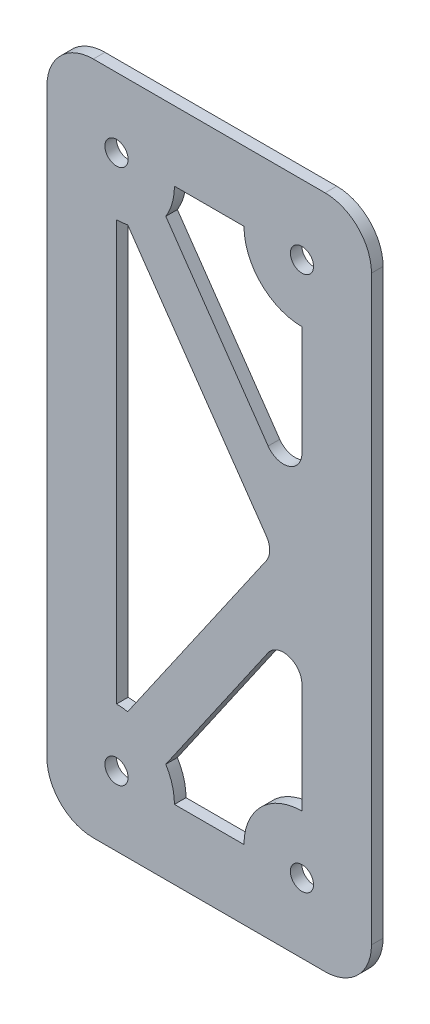
ISO-10303-21;
HEADER;
FILE_DESCRIPTION(('STEP AP214'),'2;1');
FILE_NAME('part.step','',(''),(''),'','','');
FILE_SCHEMA(('AUTOMOTIVE_DESIGN { 1 0 10303 214 1 1 1 1 }'));
ENDSEC;
DATA;
#1=APPLICATION_CONTEXT('core data for automotive mechanical design processes');
#2=APPLICATION_PROTOCOL_DEFINITION('international standard','automotive_design',2000,#1);
#3=PRODUCT_CONTEXT('',#1,'mechanical');
#4=PRODUCT('Part','Part','',(#3));
#5=PRODUCT_RELATED_PRODUCT_CATEGORY('part','',(#4));
#6=PRODUCT_DEFINITION_FORMATION('','',#4);
#7=PRODUCT_DEFINITION_CONTEXT('part definition',#1,'design');
#8=PRODUCT_DEFINITION('design','',#6,#7);
#9=PRODUCT_DEFINITION_SHAPE('','',#8);
#10=(LENGTH_UNIT() NAMED_UNIT(*) SI_UNIT(.MILLI.,.METRE.));
#11=(NAMED_UNIT(*) PLANE_ANGLE_UNIT() SI_UNIT($,.RADIAN.));
#12=(NAMED_UNIT(*) SI_UNIT($,.STERADIAN.) SOLID_ANGLE_UNIT());
#13=UNCERTAINTY_MEASURE_WITH_UNIT(LENGTH_MEASURE(1.E-05),#10,'distance_accuracy_value','');
#14=(GEOMETRIC_REPRESENTATION_CONTEXT(3) GLOBAL_UNCERTAINTY_ASSIGNED_CONTEXT((#13)) GLOBAL_UNIT_ASSIGNED_CONTEXT((#10,
#11,#12)) REPRESENTATION_CONTEXT('',''));
#15=CARTESIAN_POINT('',(0.,0.,0.));
#16=DIRECTION('',(0.,0.,1.));
#17=DIRECTION('',(1.,0.,0.));
#18=AXIS2_PLACEMENT_3D('',#15,#16,#17);
#19=CARTESIAN_POINT('',(1667.86072109709,0.,3.175));
#20=DIRECTION('',(1.,0.,0.));
#21=DIRECTION('',(0.,0.,-1.));
#22=AXIS2_PLACEMENT_3D('',#19,#20,#21);
#23=PLANE('',#22);
#24=DIRECTION('',(0.,-1.,0.));
#25=VECTOR('',#24,1.);
#26=CARTESIAN_POINT('',(1667.86072109709,0.,0.));
#27=LINE('',#26,#25);
#28=CARTESIAN_POINT('',(1667.86072109709,-4100.18496013182,0.));
#29=VERTEX_POINT('',#28);
#30=CARTESIAN_POINT('',(1667.86072109709,-4259.54741898572,0.));
#31=VERTEX_POINT('',#30);
#32=EDGE_CURVE('E463',#29,#31,#27,.T.);
#33=ORIENTED_EDGE('',*,*,#32,.F.);
#34=DIRECTION('',(0.,0.,-1.));
#35=VECTOR('',#34,1.);
#36=CARTESIAN_POINT('',(1667.86072109709,-4100.18496013182,3.175));
#37=LINE('',#36,#35);
#38=CARTESIAN_POINT('',(1667.86072109709,-4100.18496013182,3.175));
#39=VERTEX_POINT('',#38);
#40=EDGE_CURVE('E316',#29,#39,#37,.F.);
#41=ORIENTED_EDGE('',*,*,#40,.T.);
#42=DIRECTION('',(0.,-1.,0.));
#43=VECTOR('',#42,1.);
#44=CARTESIAN_POINT('',(1667.86072109709,0.,3.175));
#45=LINE('',#44,#43);
#46=CARTESIAN_POINT('',(1667.86072109709,-4259.54741898572,3.175));
#47=VERTEX_POINT('',#46);
#48=EDGE_CURVE('E492',#39,#47,#45,.T.);
#49=ORIENTED_EDGE('',*,*,#48,.T.);
#50=DIRECTION('',(0.,0.,-1.));
#51=VECTOR('',#50,1.);
#52=CARTESIAN_POINT('',(1667.86072109709,-4259.54741898572,0.));
#53=LINE('',#52,#51);
#54=EDGE_CURVE('E312',#47,#31,#53,.T.);
#55=ORIENTED_EDGE('',*,*,#54,.T.);
#56=EDGE_LOOP('',(#33,#41,#49,#55));
#57=FACE_BOUND('',#56,.T.);
#58=ADVANCED_FACE('F40',(#57),#23,.T.);
#59=CARTESIAN_POINT('',(0.,-4087.48496013182,3.175));
#60=DIRECTION('',(0.,1.,0.));
#61=DIRECTION('',(0.,0.,1.));
#62=AXIS2_PLACEMENT_3D('',#59,#60,#61);
#63=PLANE('',#62);
#64=DIRECTION('',(1.,0.,0.));
#65=VECTOR('',#64,1.);
#66=CARTESIAN_POINT('',(0.,-4087.48496013182,3.175));
#67=LINE('',#66,#65);
#68=CARTESIAN_POINT('',(1591.66072109709,-4087.48496013182,3.175));
#69=VERTEX_POINT('',#68);
#70=CARTESIAN_POINT('',(1655.16072109709,-4087.48496013182,3.175));
#71=VERTEX_POINT('',#70);
#72=EDGE_CURVE('E483',#69,#71,#67,.T.);
#73=ORIENTED_EDGE('',*,*,#72,.T.);
#74=DIRECTION('',(0.,0.,-1.));
#75=VECTOR('',#74,1.);
#76=CARTESIAN_POINT('',(1655.16072109709,-4087.48496013182,3.175));
#77=LINE('',#76,#75);
#78=CARTESIAN_POINT('',(1655.16072109709,-4087.48496013182,0.));
#79=VERTEX_POINT('',#78);
#80=EDGE_CURVE('E296',#71,#79,#77,.T.);
#81=ORIENTED_EDGE('',*,*,#80,.T.);
#82=DIRECTION('',(1.,0.,0.));
#83=VECTOR('',#82,1.);
#84=CARTESIAN_POINT('',(0.,-4087.48496013182,0.));
#85=LINE('',#84,#83);
#86=CARTESIAN_POINT('',(1591.66072109709,-4087.48496013182,0.));
#87=VERTEX_POINT('',#86);
#88=EDGE_CURVE('E359',#87,#79,#85,.T.);
#89=ORIENTED_EDGE('',*,*,#88,.F.);
#90=DIRECTION('',(0.,0.,-1.));
#91=VECTOR('',#90,1.);
#92=CARTESIAN_POINT('',(1591.66072109709,-4087.48496013182,3.175));
#93=LINE('',#92,#91);
#94=EDGE_CURVE('E293',#87,#69,#93,.F.);
#95=ORIENTED_EDGE('',*,*,#94,.T.);
#96=EDGE_LOOP('',(#73,#81,#89,#95));
#97=FACE_BOUND('',#96,.T.);
#98=ADVANCED_FACE('F473',(#97),#63,.T.);
#99=CARTESIAN_POINT('',(1578.96072109709,0.,3.175));
#100=DIRECTION('',(1.,0.,0.));
#101=DIRECTION('',(0.,0.,-1.));
#102=AXIS2_PLACEMENT_3D('',#99,#100,#101);
#103=PLANE('',#102);
#104=DIRECTION('',(0.,-1.,0.));
#105=VECTOR('',#104,1.);
#106=CARTESIAN_POINT('',(1578.96072109709,0.,3.175));
#107=LINE('',#106,#105);
#108=CARTESIAN_POINT('',(1578.96072109709,-4100.18496013182,3.175));
#109=VERTEX_POINT('',#108);
#110=CARTESIAN_POINT('',(1578.96072109709,-4259.54741898572,3.175));
#111=VERTEX_POINT('',#110);
#112=EDGE_CURVE('E482',#109,#111,#107,.T.);
#113=ORIENTED_EDGE('',*,*,#112,.F.);
#114=DIRECTION('',(0.,0.,-1.));
#115=VECTOR('',#114,1.);
#116=CARTESIAN_POINT('',(1578.96072109709,-4100.18496013182,0.));
#117=LINE('',#116,#115);
#118=CARTESIAN_POINT('',(1578.96072109709,-4100.18496013182,0.));
#119=VERTEX_POINT('',#118);
#120=EDGE_CURVE('E333',#109,#119,#117,.T.);
#121=ORIENTED_EDGE('',*,*,#120,.T.);
#122=DIRECTION('',(0.,-1.,0.));
#123=VECTOR('',#122,1.);
#124=CARTESIAN_POINT('',(1578.96072109709,0.,0.));
#125=LINE('',#124,#123);
#126=CARTESIAN_POINT('',(1578.96072109709,-4259.54741898572,0.));
#127=VERTEX_POINT('',#126);
#128=EDGE_CURVE('E353',#119,#127,#125,.T.);
#129=ORIENTED_EDGE('',*,*,#128,.T.);
#130=DIRECTION('',(0.,0.,-1.));
#131=VECTOR('',#130,1.);
#132=CARTESIAN_POINT('',(1578.96072109709,-4259.54741898572,3.175));
#133=LINE('',#132,#131);
#134=EDGE_CURVE('E330',#127,#111,#133,.F.);
#135=ORIENTED_EDGE('',*,*,#134,.T.);
#136=EDGE_LOOP('',(#113,#121,#129,#135));
#137=FACE_BOUND('',#136,.T.);
#138=ADVANCED_FACE('F485',(#137),#103,.F.);
#139=CARTESIAN_POINT('',(1648.81072109709,-4253.19741898572,3.175));
#140=DIRECTION('',(0.,0.,-1.));
#141=DIRECTION('',(-1.,0.,0.));
#142=AXIS2_PLACEMENT_3D('',#139,#140,#141);
#143=CYLINDRICAL_SURFACE('',#142,15.8749999999997);
#144=CARTESIAN_POINT('',(1648.81072109709,-4253.19741898572,0.));
#145=DIRECTION('',(0.,0.,1.));
#146=DIRECTION('',(1.,0.,0.));
#147=AXIS2_PLACEMENT_3D('',#144,#145,#146);
#148=CIRCLE('',#147,15.8749999999997);
#149=CARTESIAN_POINT('',(1648.81072109709,-4237.32241898572,0.));
#150=VERTEX_POINT('',#149);
#151=CARTESIAN_POINT('',(1632.93572109709,-4253.19741898572,0.));
#152=VERTEX_POINT('',#151);
#153=EDGE_CURVE('E441',#150,#152,#148,.T.);
#154=ORIENTED_EDGE('',*,*,#153,.T.);
#155=DIRECTION('',(0.,0.,-1.));
#156=VECTOR('',#155,1.);
#157=CARTESIAN_POINT('',(1632.93572109709,-4253.19741898572,3.175));
#158=LINE('',#157,#156);
#159=CARTESIAN_POINT('',(1632.93572109709,-4253.19741898572,3.175));
#160=VERTEX_POINT('',#159);
#161=EDGE_CURVE('E260',#160,#152,#158,.T.);
#162=ORIENTED_EDGE('',*,*,#161,.F.);
#163=CARTESIAN_POINT('',(1648.81072109709,-4253.19741898572,3.175));
#164=DIRECTION('',(0.,0.,1.));
#165=DIRECTION('',(1.,0.,0.));
#166=AXIS2_PLACEMENT_3D('',#163,#164,#165);
#167=CIRCLE('',#166,15.8749999999997);
#168=CARTESIAN_POINT('',(1648.81072109709,-4237.32241898572,3.175));
#169=VERTEX_POINT('',#168);
#170=EDGE_CURVE('E530',#169,#160,#167,.T.);
#171=ORIENTED_EDGE('',*,*,#170,.F.);
#172=DIRECTION('',(0.,0.,-1.));
#173=VECTOR('',#172,1.);
#174=CARTESIAN_POINT('',(1648.81072109709,-4237.32241898572,3.175));
#175=LINE('',#174,#173);
#176=EDGE_CURVE('E363',#169,#150,#175,.T.);
#177=ORIENTED_EDGE('',*,*,#176,.T.);
#178=EDGE_LOOP('',(#154,#162,#171,#177));
#179=FACE_BOUND('',#178,.T.);
#180=ADVANCED_FACE('F599',(#179),#143,.T.);
#181=CARTESIAN_POINT('',(7.43621685485709E-11,-4253.19741898575,3.175));
#182=DIRECTION('',(0.,-1.,0.));
#183=DIRECTION('',(1.,0.,0.));
#184=AXIS2_PLACEMENT_3D('',#181,#182,#183);
#185=PLANE('',#184);
#186=DIRECTION('',(-1.,0.,0.));
#187=VECTOR('',#186,1.);
#188=CARTESIAN_POINT('',(7.43621685485709E-11,-4253.19741898575,0.));
#189=LINE('',#188,#187);
#190=CARTESIAN_POINT('',(1613.88572109709,-4253.19741898572,0.));
#191=VERTEX_POINT('',#190);
#192=EDGE_CURVE('E445',#152,#191,#189,.T.);
#193=ORIENTED_EDGE('',*,*,#192,.T.);
#194=DIRECTION('',(0.,0.,-1.));
#195=VECTOR('',#194,1.);
#196=CARTESIAN_POINT('',(1613.88572109709,-4253.19741898572,3.175));
#197=LINE('',#196,#195);
#198=CARTESIAN_POINT('',(1613.88572109709,-4253.19741898572,3.175));
#199=VERTEX_POINT('',#198);
#200=EDGE_CURVE('E372',#199,#191,#197,.T.);
#201=ORIENTED_EDGE('',*,*,#200,.F.);
#202=DIRECTION('',(-1.,0.,0.));
#203=VECTOR('',#202,1.);
#204=CARTESIAN_POINT('',(7.43621685485709E-11,-4253.19741898575,3.175));
#205=LINE('',#204,#203);
#206=EDGE_CURVE('E534',#160,#199,#205,.T.);
#207=ORIENTED_EDGE('',*,*,#206,.F.);
#208=ORIENTED_EDGE('',*,*,#161,.T.);
#209=EDGE_LOOP('',(#193,#201,#207,#208));
#210=FACE_BOUND('',#209,.T.);
#211=ADVANCED_FACE('F595',(#210),#185,.F.);
#212=CARTESIAN_POINT('',(1598.01072109709,-4253.19741898572,3.175));
#213=DIRECTION('',(0.,0.,-1.));
#214=DIRECTION('',(-1.,0.,0.));
#215=AXIS2_PLACEMENT_3D('',#212,#213,#214);
#216=CYLINDRICAL_SURFACE('',#215,15.8749999999997);
#217=CARTESIAN_POINT('',(1598.01072109709,-4253.19741898572,0.));
#218=DIRECTION('',(0.,0.,1.));
#219=DIRECTION('',(1.,0.,0.));
#220=AXIS2_PLACEMENT_3D('',#217,#218,#219);
#221=CIRCLE('',#220,15.8749999999997);
#222=CARTESIAN_POINT('',(1611.51594221686,-4244.85328167225,0.));
#223=VERTEX_POINT('',#222);
#224=EDGE_CURVE('E448',#191,#223,#221,.T.);
#225=ORIENTED_EDGE('',*,*,#224,.T.);
#226=DIRECTION('',(0.,0.,-1.));
#227=VECTOR('',#226,1.);
#228=CARTESIAN_POINT('',(1611.51594221686,-4244.85328167225,3.175));
#229=LINE('',#228,#227);
#230=CARTESIAN_POINT('',(1611.51594221686,-4244.85328167225,3.175));
#231=VERTEX_POINT('',#230);
#232=EDGE_CURVE('E367',#231,#223,#229,.T.);
#233=ORIENTED_EDGE('',*,*,#232,.F.);
#234=CARTESIAN_POINT('',(1598.01072109709,-4253.19741898572,3.175));
#235=DIRECTION('',(0.,0.,1.));
#236=DIRECTION('',(1.,0.,0.));
#237=AXIS2_PLACEMENT_3D('',#234,#235,#236);
#238=CIRCLE('',#237,15.8749999999997);
#239=EDGE_CURVE('E537',#199,#231,#238,.T.);
#240=ORIENTED_EDGE('',*,*,#239,.F.);
#241=ORIENTED_EDGE('',*,*,#200,.T.);
#242=EDGE_LOOP('',(#225,#233,#240,#241));
#243=FACE_BOUND('',#242,.T.);
#244=ADVANCED_FACE('F591',(#243),#216,.T.);
#245=CARTESIAN_POINT('',(3075.97149747778,-2130.87048032548,3.175));
#246=DIRECTION('',(0.822023094017505,-0.56945415346794,0.));
#247=DIRECTION('',(0.56945415346794,0.822023094017505,0.));
#248=AXIS2_PLACEMENT_3D('',#245,#246,#247);
#249=PLANE('',#248);
#250=DIRECTION('',(-0.56945415346794,-0.822023094017505,0.));
#251=VECTOR('',#250,1.);
#252=CARTESIAN_POINT('',(3075.97149747778,-2130.87048032548,0.));
#253=LINE('',#252,#251);
#254=CARTESIAN_POINT('',(1639.55484377948,-4204.37833829886,0.));
#255=VERTEX_POINT('',#254);
#256=EDGE_CURVE('E452',#255,#223,#253,.T.);
#257=ORIENTED_EDGE('',*,*,#256,.F.);
#258=DIRECTION('',(0.,0.,-1.));
#259=VECTOR('',#258,1.);
#260=CARTESIAN_POINT('',(1639.55484377948,-4204.37833829885,3.175));
#261=LINE('',#260,#259);
#262=CARTESIAN_POINT('',(1639.55484377948,-4204.37833829886,3.175));
#263=VERTEX_POINT('',#262);
#264=EDGE_CURVE('E267',#255,#263,#261,.F.);
#265=ORIENTED_EDGE('',*,*,#264,.T.);
#266=DIRECTION('',(-0.56945415346794,-0.822023094017505,0.));
#267=VECTOR('',#266,1.);
#268=CARTESIAN_POINT('',(3075.97149747778,-2130.87048032548,3.175));
#269=LINE('',#268,#267);
#270=EDGE_CURVE('E540',#263,#231,#269,.T.);
#271=ORIENTED_EDGE('',*,*,#270,.T.);
#272=ORIENTED_EDGE('',*,*,#232,.T.);
#273=EDGE_LOOP('',(#257,#265,#271,#272));
#274=FACE_BOUND('',#273,.T.);
#275=ADVANCED_FACE('F587',(#274),#249,.T.);
#276=CARTESIAN_POINT('',(1598.01072109709,-4106.53496013182,3.175));
#277=DIRECTION('',(0.,0.,-1.));
#278=DIRECTION('',(-1.,0.,0.));
#279=AXIS2_PLACEMENT_3D('',#276,#277,#278);
#280=CYLINDRICAL_SURFACE('',#279,15.8749999999997);
#281=CARTESIAN_POINT('',(1598.01072109709,-4106.53496013182,0.));
#282=DIRECTION('',(0.,0.,1.));
#283=DIRECTION('',(1.,0.,0.));
#284=AXIS2_PLACEMENT_3D('',#281,#282,#283);
#285=CIRCLE('',#284,15.8749999999997);
#286=CARTESIAN_POINT('',(1598.01072109709,-4122.40996013182,0.));
#287=VERTEX_POINT('',#286);
#288=CARTESIAN_POINT('',(1601.07624892284,-4122.11116519433,0.));
#289=VERTEX_POINT('',#288);
#290=EDGE_CURVE('E414',#287,#289,#285,.T.);
#291=ORIENTED_EDGE('',*,*,#290,.T.);
#292=DIRECTION('',(0.,0.,-1.));
#293=VECTOR('',#292,1.);
#294=CARTESIAN_POINT('',(1601.07624892284,-4122.11116519433,3.175));
#295=LINE('',#294,#293);
#296=CARTESIAN_POINT('',(1601.07624892284,-4122.11116519433,3.175));
#297=VERTEX_POINT('',#296);
#298=EDGE_CURVE('E368',#297,#289,#295,.T.);
#299=ORIENTED_EDGE('',*,*,#298,.F.);
#300=CARTESIAN_POINT('',(1598.01072109709,-4106.53496013182,3.175));
#301=DIRECTION('',(0.,0.,1.));
#302=DIRECTION('',(1.,0.,0.));
#303=AXIS2_PLACEMENT_3D('',#300,#301,#302);
#304=CIRCLE('',#303,15.8749999999997);
#305=CARTESIAN_POINT('',(1598.01072109709,-4122.40996013182,3.175));
#306=VERTEX_POINT('',#305);
#307=EDGE_CURVE('E509',#306,#297,#304,.T.);
#308=ORIENTED_EDGE('',*,*,#307,.F.);
#309=DIRECTION('',(0.,0.,-1.));
#310=VECTOR('',#309,1.);
#311=CARTESIAN_POINT('',(1598.01072109709,-4122.40996013182,3.175));
#312=LINE('',#311,#310);
#313=EDGE_CURVE('E244',#306,#287,#312,.T.);
#314=ORIENTED_EDGE('',*,*,#313,.T.);
#315=EDGE_LOOP('',(#291,#299,#308,#314));
#316=FACE_BOUND('',#315,.T.);
#317=ADVANCED_FACE('F590',(#316),#280,.T.);
#318=CARTESIAN_POINT('',(-847.696249813411,-587.239158910005,3.175));
#319=DIRECTION('',(-0.822023094017507,-0.569454153467937,0.));
#320=DIRECTION('',(0.569454153467937,-0.822023094017507,0.));
#321=AXIS2_PLACEMENT_3D('',#318,#319,#320);
#322=PLANE('',#321);
#323=DIRECTION('',(-0.569454153467937,0.822023094017507,0.));
#324=VECTOR('',#323,1.);
#325=CARTESIAN_POINT('',(-847.696249813411,-587.239158910005,0.));
#326=LINE('',#325,#324);
#327=CARTESIAN_POINT('',(1639.08187957749,-4176.97336245915,0.));
#328=VERTEX_POINT('',#327);
#329=EDGE_CURVE('E425',#328,#289,#326,.T.);
#330=ORIENTED_EDGE('',*,*,#329,.F.);
#331=DIRECTION('',(0.,0.,-1.));
#332=VECTOR('',#331,1.);
#333=CARTESIAN_POINT('',(1639.08187957749,-4176.97336245915,3.175));
#334=LINE('',#333,#332);
#335=CARTESIAN_POINT('',(1639.08187957749,-4176.97336245915,3.175));
#336=VERTEX_POINT('',#335);
#337=EDGE_CURVE('E259',#328,#336,#334,.F.);
#338=ORIENTED_EDGE('',*,*,#337,.T.);
#339=DIRECTION('',(-0.569454153467937,0.822023094017507,0.));
#340=VECTOR('',#339,1.);
#341=CARTESIAN_POINT('',(-847.696249813411,-587.239158910005,3.175));
#342=LINE('',#341,#340);
#343=EDGE_CURVE('E514',#336,#297,#342,.T.);
#344=ORIENTED_EDGE('',*,*,#343,.T.);
#345=ORIENTED_EDGE('',*,*,#298,.T.);
#346=EDGE_LOOP('',(#330,#338,#344,#345));
#347=FACE_BOUND('',#346,.T.);
#348=ADVANCED_FACE('F618',(#347),#322,.T.);
#349=CARTESIAN_POINT('',(3065.53180418376,-2123.63841257638,3.175));
#350=DIRECTION('',(0.822023094017512,-0.569454153467929,0.));
#351=DIRECTION('',(0.569454153467929,0.822023094017512,0.));
#352=AXIS2_PLACEMENT_3D('',#349,#350,#351);
#353=PLANE('',#352);
#354=DIRECTION('',(-0.569454153467929,-0.822023094017512,0.));
#355=VECTOR('',#354,1.);
#356=CARTESIAN_POINT('',(3065.53180418376,-2123.63841257638,3.175));
#357=LINE('',#356,#355);
#358=CARTESIAN_POINT('',(1639.08187957749,-4182.75901665839,3.175));
#359=VERTEX_POINT('',#358);
#360=CARTESIAN_POINT('',(1601.07624892284,-4237.6212139232,3.175));
#361=VERTEX_POINT('',#360);
#362=EDGE_CURVE('E517',#359,#361,#357,.T.);
#363=ORIENTED_EDGE('',*,*,#362,.F.);
#364=DIRECTION('',(0.,0.,-1.));
#365=VECTOR('',#364,1.);
#366=CARTESIAN_POINT('',(1639.08187957749,-4182.75901665839,3.175));
#367=LINE('',#366,#365);
#368=CARTESIAN_POINT('',(1639.08187957749,-4182.75901665839,0.));
#369=VERTEX_POINT('',#368);
#370=EDGE_CURVE('E255',#359,#369,#367,.T.);
#371=ORIENTED_EDGE('',*,*,#370,.T.);
#372=DIRECTION('',(-0.569454153467929,-0.822023094017512,0.));
#373=VECTOR('',#372,1.);
#374=CARTESIAN_POINT('',(3065.53180418376,-2123.63841257638,0.));
#375=LINE('',#374,#373);
#376=CARTESIAN_POINT('',(1601.07624892284,-4237.6212139232,0.));
#377=VERTEX_POINT('',#376);
#378=EDGE_CURVE('E428',#369,#377,#375,.T.);
#379=ORIENTED_EDGE('',*,*,#378,.T.);
#380=DIRECTION('',(0.,0.,-1.));
#381=VECTOR('',#380,1.);
#382=CARTESIAN_POINT('',(1601.07624892284,-4237.6212139232,3.175));
#383=LINE('',#382,#381);
#384=EDGE_CURVE('E382',#361,#377,#383,.T.);
#385=ORIENTED_EDGE('',*,*,#384,.F.);
#386=EDGE_LOOP('',(#363,#371,#379,#385));
#387=FACE_BOUND('',#386,.T.);
#388=ADVANCED_FACE('F614',(#387),#353,.F.);
#389=CARTESIAN_POINT('',(1598.01072109709,-4253.19741898572,3.175));
#390=DIRECTION('',(0.,0.,-1.));
#391=DIRECTION('',(-1.,0.,0.));
#392=AXIS2_PLACEMENT_3D('',#389,#390,#391);
#393=CYLINDRICAL_SURFACE('',#392,15.8749999999997);
#394=CARTESIAN_POINT('',(1598.01072109709,-4253.19741898572,0.));
#395=DIRECTION('',(0.,0.,1.));
#396=DIRECTION('',(1.,0.,0.));
#397=AXIS2_PLACEMENT_3D('',#394,#395,#396);
#398=CIRCLE('',#397,15.8749999999997);
#399=CARTESIAN_POINT('',(1598.01072109709,-4237.32241898572,0.));
#400=VERTEX_POINT('',#399);
#401=EDGE_CURVE('E431',#377,#400,#398,.T.);
#402=ORIENTED_EDGE('',*,*,#401,.T.);
#403=DIRECTION('',(0.,0.,-1.));
#404=VECTOR('',#403,1.);
#405=CARTESIAN_POINT('',(1598.01072109709,-4237.32241898572,3.175));
#406=LINE('',#405,#404);
#407=CARTESIAN_POINT('',(1598.01072109709,-4237.32241898572,3.175));
#408=VERTEX_POINT('',#407);
#409=EDGE_CURVE('E248',#408,#400,#406,.T.);
#410=ORIENTED_EDGE('',*,*,#409,.F.);
#411=CARTESIAN_POINT('',(1598.01072109709,-4253.19741898572,3.175));
#412=DIRECTION('',(0.,0.,1.));
#413=DIRECTION('',(1.,0.,0.));
#414=AXIS2_PLACEMENT_3D('',#411,#412,#413);
#415=CIRCLE('',#414,15.8749999999997);
#416=EDGE_CURVE('E520',#361,#408,#415,.T.);
#417=ORIENTED_EDGE('',*,*,#416,.F.);
#418=ORIENTED_EDGE('',*,*,#384,.T.);
#419=EDGE_LOOP('',(#402,#410,#417,#418));
#420=FACE_BOUND('',#419,.T.);
#421=ADVANCED_FACE('F611',(#420),#393,.T.);
#422=CARTESIAN_POINT('',(-837.256556519391,-580.007091160965,3.175));
#423=DIRECTION('',(-0.822023094017507,-0.569454153467938,0.));
#424=DIRECTION('',(0.569454153467938,-0.822023094017507,0.));
#425=AXIS2_PLACEMENT_3D('',#422,#423,#424);
#426=PLANE('',#425);
#427=DIRECTION('',(-0.569454153467938,0.822023094017507,0.));
#428=VECTOR('',#427,1.);
#429=CARTESIAN_POINT('',(-837.256556519391,-580.007091160965,3.175));
#430=LINE('',#429,#428);
#431=CARTESIAN_POINT('',(1639.55484377948,-4155.35404081868,3.175));
#432=VERTEX_POINT('',#431);
#433=CARTESIAN_POINT('',(1611.51594221686,-4114.87909744529,3.175));
#434=VERTEX_POINT('',#433);
#435=EDGE_CURVE('E213',#432,#434,#430,.T.);
#436=ORIENTED_EDGE('',*,*,#435,.F.);
#437=DIRECTION('',(0.,0.,-1.));
#438=VECTOR('',#437,1.);
#439=CARTESIAN_POINT('',(1639.55484377948,-4155.35404081868,0.));
#440=LINE('',#439,#438);
#441=CARTESIAN_POINT('',(1639.55484377948,-4155.35404081868,0.));
#442=VERTEX_POINT('',#441);
#443=EDGE_CURVE('E270',#432,#442,#440,.T.);
#444=ORIENTED_EDGE('',*,*,#443,.T.);
#445=DIRECTION('',(-0.569454153467938,0.822023094017507,0.));
#446=VECTOR('',#445,1.);
#447=CARTESIAN_POINT('',(-837.256556519391,-580.007091160965,0.));
#448=LINE('',#447,#446);
#449=CARTESIAN_POINT('',(1611.51594221686,-4114.87909744529,0.));
#450=VERTEX_POINT('',#449);
#451=EDGE_CURVE('E241',#442,#450,#448,.T.);
#452=ORIENTED_EDGE('',*,*,#451,.T.);
#453=DIRECTION('',(0.,0.,-1.));
#454=VECTOR('',#453,1.);
#455=CARTESIAN_POINT('',(1611.51594221686,-4114.87909744529,3.175));
#456=LINE('',#455,#454);
#457=EDGE_CURVE('E232',#434,#450,#456,.T.);
#458=ORIENTED_EDGE('',*,*,#457,.F.);
#459=EDGE_LOOP('',(#436,#444,#452,#458));
#460=FACE_BOUND('',#459,.T.);
#461=ADVANCED_FACE('F239',(#460),#426,.F.);
#462=CARTESIAN_POINT('',(1598.01072109709,-4106.53496013182,3.175));
#463=DIRECTION('',(0.,0.,-1.));
#464=DIRECTION('',(-1.,0.,0.));
#465=AXIS2_PLACEMENT_3D('',#462,#463,#464);
#466=CYLINDRICAL_SURFACE('',#465,15.8749999999997);
#467=CARTESIAN_POINT('',(1598.01072109709,-4106.53496013182,0.));
#468=DIRECTION('',(0.,0.,1.));
#469=DIRECTION('',(1.,0.,0.));
#470=AXIS2_PLACEMENT_3D('',#467,#468,#469);
#471=CIRCLE('',#470,15.8749999999997);
#472=CARTESIAN_POINT('',(1613.88572109709,-4106.53496013182,0.));
#473=VERTEX_POINT('',#472);
#474=EDGE_CURVE('E418',#450,#473,#471,.T.);
#475=ORIENTED_EDGE('',*,*,#474,.T.);
#476=DIRECTION('',(0.,0.,-1.));
#477=VECTOR('',#476,1.);
#478=CARTESIAN_POINT('',(1613.88572109709,-4106.53496013182,3.175));
#479=LINE('',#478,#477);
#480=CARTESIAN_POINT('',(1613.88572109709,-4106.53496013182,3.175));
#481=VERTEX_POINT('',#480);
#482=EDGE_CURVE('E234',#481,#473,#479,.T.);
#483=ORIENTED_EDGE('',*,*,#482,.F.);
#484=CARTESIAN_POINT('',(1598.01072109709,-4106.53496013182,3.175));
#485=DIRECTION('',(0.,0.,1.));
#486=DIRECTION('',(1.,0.,0.));
#487=AXIS2_PLACEMENT_3D('',#484,#485,#486);
#488=CIRCLE('',#487,15.8749999999997);
#489=EDGE_CURVE('E218',#434,#481,#488,.T.);
#490=ORIENTED_EDGE('',*,*,#489,.F.);
#491=ORIENTED_EDGE('',*,*,#457,.T.);
#492=EDGE_LOOP('',(#475,#483,#490,#491));
#493=FACE_BOUND('',#492,.T.);
#494=ADVANCED_FACE('F231',(#493),#466,.T.);
#495=CARTESIAN_POINT('',(7.17979474671891E-11,-4106.53496013184,3.175));
#496=DIRECTION('',(0.,1.,0.));
#497=DIRECTION('',(-1.,0.,0.));
#498=AXIS2_PLACEMENT_3D('',#495,#496,#497);
#499=PLANE('',#498);
#500=DIRECTION('',(1.,0.,0.));
#501=VECTOR('',#500,1.);
#502=CARTESIAN_POINT('',(7.17979474671891E-11,-4106.53496013184,0.));
#503=LINE('',#502,#501);
#504=CARTESIAN_POINT('',(1632.93572109709,-4106.53496013182,0.));
#505=VERTEX_POINT('',#504);
#506=EDGE_CURVE('E407',#473,#505,#503,.T.);
#507=ORIENTED_EDGE('',*,*,#506,.T.);
#508=DIRECTION('',(0.,0.,-1.));
#509=VECTOR('',#508,1.);
#510=CARTESIAN_POINT('',(1632.93572109709,-4106.53496013182,3.175));
#511=LINE('',#510,#509);
#512=CARTESIAN_POINT('',(1632.93572109709,-4106.53496013182,3.175));
#513=VERTEX_POINT('',#512);
#514=EDGE_CURVE('E251',#513,#505,#511,.T.);
#515=ORIENTED_EDGE('',*,*,#514,.F.);
#516=DIRECTION('',(1.,0.,0.));
#517=VECTOR('',#516,1.);
#518=CARTESIAN_POINT('',(7.17979474671891E-11,-4106.53496013184,3.175));
#519=LINE('',#518,#517);
#520=EDGE_CURVE('E237',#481,#513,#519,.T.);
#521=ORIENTED_EDGE('',*,*,#520,.F.);
#522=ORIENTED_EDGE('',*,*,#482,.T.);
#523=EDGE_LOOP('',(#507,#515,#521,#522));
#524=FACE_BOUND('',#523,.T.);
#525=ADVANCED_FACE('F501',(#524),#499,.F.);
#526=CARTESIAN_POINT('',(1648.81072109709,-4106.53496013182,3.175));
#527=DIRECTION('',(0.,0.,-1.));
#528=DIRECTION('',(-1.,0.,0.));
#529=AXIS2_PLACEMENT_3D('',#526,#527,#528);
#530=CYLINDRICAL_SURFACE('',#529,15.8749999999997);
#531=CARTESIAN_POINT('',(1648.81072109709,-4106.53496013182,0.));
#532=DIRECTION('',(0.,0.,1.));
#533=DIRECTION('',(1.,0.,0.));
#534=AXIS2_PLACEMENT_3D('',#531,#532,#533);
#535=CIRCLE('',#534,15.8749999999997);
#536=CARTESIAN_POINT('',(1648.81072109709,-4122.40996013182,0.));
#537=VERTEX_POINT('',#536);
#538=EDGE_CURVE('E400',#505,#537,#535,.T.);
#539=ORIENTED_EDGE('',*,*,#538,.T.);
#540=DIRECTION('',(0.,0.,-1.));
#541=VECTOR('',#540,1.);
#542=CARTESIAN_POINT('',(1648.81072109709,-4122.40996013182,3.175));
#543=LINE('',#542,#541);
#544=CARTESIAN_POINT('',(1648.81072109709,-4122.40996013182,3.175));
#545=VERTEX_POINT('',#544);
#546=EDGE_CURVE('E389',#545,#537,#543,.T.);
#547=ORIENTED_EDGE('',*,*,#546,.F.);
#548=CARTESIAN_POINT('',(1648.81072109709,-4106.53496013182,3.175));
#549=DIRECTION('',(0.,0.,1.));
#550=DIRECTION('',(1.,0.,0.));
#551=AXIS2_PLACEMENT_3D('',#548,#549,#550);
#552=CIRCLE('',#551,15.8749999999997);
#553=EDGE_CURVE('E401',#513,#545,#552,.T.);
#554=ORIENTED_EDGE('',*,*,#553,.F.);
#555=ORIENTED_EDGE('',*,*,#514,.T.);
#556=EDGE_LOOP('',(#539,#547,#554,#555));
#557=FACE_BOUND('',#556,.T.);
#558=ADVANCED_FACE('F398',(#557),#530,.T.);
#559=CARTESIAN_POINT('',(1598.01072109709,-4253.19741898572,3.175));
#560=DIRECTION('',(0.,0.,-1.));
#561=DIRECTION('',(-1.,0.,0.));
#562=AXIS2_PLACEMENT_3D('',#559,#560,#561);
#563=CYLINDRICAL_SURFACE('',#562,3.17499999999975);
#564=CARTESIAN_POINT('',(1598.01072109709,-4253.19741898572,3.175));
#565=DIRECTION('',(0.,0.,1.));
#566=DIRECTION('',(1.,0.,0.));
#567=AXIS2_PLACEMENT_3D('',#564,#565,#566);
#568=CIRCLE('',#567,3.17499999999975);
#569=CARTESIAN_POINT('',(1601.18572109709,-4253.19741898572,3.175));
#570=VERTEX_POINT('',#569);
#571=EDGE_CURVE('E547',#570,#570,#568,.T.);
#572=ORIENTED_EDGE('',*,*,#571,.T.);
#573=EDGE_LOOP('',(#572));
#574=FACE_BOUND('',#573,.T.);
#575=CARTESIAN_POINT('',(1598.01072109709,-4253.19741898572,0.));
#576=DIRECTION('',(0.,0.,1.));
#577=DIRECTION('',(1.,0.,0.));
#578=AXIS2_PLACEMENT_3D('',#575,#576,#577);
#579=CIRCLE('',#578,3.17499999999975);
#580=CARTESIAN_POINT('',(1601.18572109709,-4253.19741898572,0.));
#581=VERTEX_POINT('',#580);
#582=EDGE_CURVE('E459',#581,#581,#579,.T.);
#583=ORIENTED_EDGE('',*,*,#582,.F.);
#584=EDGE_LOOP('',(#583));
#585=FACE_BOUND('',#584,.T.);
#586=ADVANCED_FACE('F573',(#574,#585),#563,.F.);
#587=CARTESIAN_POINT('',(1648.81072109709,-4253.19741898572,3.175));
#588=DIRECTION('',(0.,0.,-1.));
#589=DIRECTION('',(-1.,0.,0.));
#590=AXIS2_PLACEMENT_3D('',#587,#588,#589);
#591=CYLINDRICAL_SURFACE('',#590,3.17499999999975);
#592=CARTESIAN_POINT('',(1648.81072109709,-4253.19741898572,3.175));
#593=DIRECTION('',(0.,0.,1.));
#594=DIRECTION('',(1.,0.,0.));
#595=AXIS2_PLACEMENT_3D('',#592,#593,#594);
#596=CIRCLE('',#595,3.17499999999975);
#597=CARTESIAN_POINT('',(1651.98572109709,-4253.19741898572,3.175));
#598=VERTEX_POINT('',#597);
#599=EDGE_CURVE('E543',#598,#598,#596,.T.);
#600=ORIENTED_EDGE('',*,*,#599,.T.);
#601=EDGE_LOOP('',(#600));
#602=FACE_BOUND('',#601,.T.);
#603=CARTESIAN_POINT('',(1648.81072109709,-4253.19741898572,0.));
#604=DIRECTION('',(0.,0.,1.));
#605=DIRECTION('',(1.,0.,0.));
#606=AXIS2_PLACEMENT_3D('',#603,#604,#605);
#607=CIRCLE('',#606,3.17499999999975);
#608=CARTESIAN_POINT('',(1651.98572109709,-4253.19741898572,0.));
#609=VERTEX_POINT('',#608);
#610=EDGE_CURVE('E455',#609,#609,#607,.T.);
#611=ORIENTED_EDGE('',*,*,#610,.F.);
#612=EDGE_LOOP('',(#611));
#613=FACE_BOUND('',#612,.T.);
#614=ADVANCED_FACE('F576',(#602,#613),#591,.F.);
#615=CARTESIAN_POINT('',(1648.81072109706,1.24813646253826E-11,3.175));
#616=DIRECTION('',(1.,0.,0.));
#617=DIRECTION('',(0.,1.,0.));
#618=AXIS2_PLACEMENT_3D('',#615,#616,#617);
#619=PLANE('',#618);
#620=DIRECTION('',(0.,-1.,0.));
#621=VECTOR('',#620,1.);
#622=CARTESIAN_POINT('',(1648.81072109706,1.24813646253826E-11,3.175));
#623=LINE('',#622,#621);
#624=CARTESIAN_POINT('',(1648.81072109709,-4207.27116539847,3.175));
#625=VERTEX_POINT('',#624);
#626=EDGE_CURVE('E510',#625,#169,#623,.T.);
#627=ORIENTED_EDGE('',*,*,#626,.F.);
#628=DIRECTION('',(0.,0.,-1.));
#629=VECTOR('',#628,1.);
#630=CARTESIAN_POINT('',(1648.81072109709,-4207.27116539847,3.175));
#631=LINE('',#630,#629);
#632=CARTESIAN_POINT('',(1648.81072109709,-4207.27116539847,0.));
#633=VERTEX_POINT('',#632);
#634=EDGE_CURVE('E263',#625,#633,#631,.T.);
#635=ORIENTED_EDGE('',*,*,#634,.T.);
#636=DIRECTION('',(0.,-1.,0.));
#637=VECTOR('',#636,1.);
#638=CARTESIAN_POINT('',(1648.81072109706,1.24813646253826E-11,0.));
#639=LINE('',#638,#637);
#640=EDGE_CURVE('E416',#633,#150,#639,.T.);
#641=ORIENTED_EDGE('',*,*,#640,.T.);
#642=ORIENTED_EDGE('',*,*,#176,.F.);
#643=EDGE_LOOP('',(#627,#635,#641,#642));
#644=FACE_BOUND('',#643,.T.);
#645=ADVANCED_FACE('F580',(#644),#619,.F.);
#646=CARTESIAN_POINT('',(1648.81072109709,-4106.53496013182,3.175));
#647=DIRECTION('',(0.,0.,-1.));
#648=DIRECTION('',(-1.,0.,0.));
#649=AXIS2_PLACEMENT_3D('',#646,#647,#648);
#650=CYLINDRICAL_SURFACE('',#649,3.17499999999975);
#651=CARTESIAN_POINT('',(1648.81072109709,-4106.53496013182,3.175));
#652=DIRECTION('',(0.,0.,1.));
#653=DIRECTION('',(1.,0.,0.));
#654=AXIS2_PLACEMENT_3D('',#651,#652,#653);
#655=CIRCLE('',#654,3.17499999999975);
#656=CARTESIAN_POINT('',(1651.98572109709,-4106.53496013182,3.175));
#657=VERTEX_POINT('',#656);
#658=EDGE_CURVE('E526',#657,#657,#655,.T.);
#659=ORIENTED_EDGE('',*,*,#658,.T.);
#660=EDGE_LOOP('',(#659));
#661=FACE_BOUND('',#660,.T.);
#662=CARTESIAN_POINT('',(1648.81072109709,-4106.53496013182,0.));
#663=DIRECTION('',(0.,0.,1.));
#664=DIRECTION('',(1.,0.,0.));
#665=AXIS2_PLACEMENT_3D('',#662,#663,#664);
#666=CIRCLE('',#665,3.17499999999975);
#667=CARTESIAN_POINT('',(1651.98572109709,-4106.53496013182,0.));
#668=VERTEX_POINT('',#667);
#669=EDGE_CURVE('E437',#668,#668,#666,.T.);
#670=ORIENTED_EDGE('',*,*,#669,.F.);
#671=EDGE_LOOP('',(#670));
#672=FACE_BOUND('',#671,.T.);
#673=ADVANCED_FACE('F584',(#661,#672),#650,.F.);
#674=CARTESIAN_POINT('',(1598.01072109706,1.20968127087457E-11,3.175));
#675=DIRECTION('',(-1.,0.,0.));
#676=DIRECTION('',(0.,-1.,0.));
#677=AXIS2_PLACEMENT_3D('',#674,#675,#676);
#678=PLANE('',#677);
#679=DIRECTION('',(0.,1.,0.));
#680=VECTOR('',#679,1.);
#681=CARTESIAN_POINT('',(1598.01072109706,1.20968127087457E-11,0.));
#682=LINE('',#681,#680);
#683=EDGE_CURVE('E434',#400,#287,#682,.T.);
#684=ORIENTED_EDGE('',*,*,#683,.T.);
#685=ORIENTED_EDGE('',*,*,#313,.F.);
#686=DIRECTION('',(0.,1.,0.));
#687=VECTOR('',#686,1.);
#688=CARTESIAN_POINT('',(1598.01072109706,1.20968127087457E-11,3.175));
#689=LINE('',#688,#687);
#690=EDGE_CURVE('E523',#408,#306,#689,.T.);
#691=ORIENTED_EDGE('',*,*,#690,.F.);
#692=ORIENTED_EDGE('',*,*,#409,.T.);
#693=EDGE_LOOP('',(#684,#685,#691,#692));
#694=FACE_BOUND('',#693,.T.);
#695=ADVANCED_FACE('F606',(#694),#678,.F.);
#696=CARTESIAN_POINT('',(1648.81072109709,-4152.46121371907,0.));
#697=VERTEX_POINT('',#696);
#698=EDGE_CURVE('E409',#537,#697,#639,.T.);
#699=ORIENTED_EDGE('',*,*,#698,.T.);
#700=DIRECTION('',(0.,0.,-1.));
#701=VECTOR('',#700,1.);
#702=CARTESIAN_POINT('',(1648.81072109709,-4152.46121371907,3.175));
#703=LINE('',#702,#701);
#704=CARTESIAN_POINT('',(1648.81072109709,-4152.46121371907,3.175));
#705=VERTEX_POINT('',#704);
#706=EDGE_CURVE('E273',#697,#705,#703,.F.);
#707=ORIENTED_EDGE('',*,*,#706,.T.);
#708=EDGE_CURVE('E505',#545,#705,#623,.T.);
#709=ORIENTED_EDGE('',*,*,#708,.F.);
#710=ORIENTED_EDGE('',*,*,#546,.T.);
#711=EDGE_LOOP('',(#699,#707,#709,#710));
#712=FACE_BOUND('',#711,.T.);
#713=ADVANCED_FACE('F586',(#712),#619,.F.);
#714=CARTESIAN_POINT('',(1598.01072109709,-4106.53496013182,3.175));
#715=DIRECTION('',(0.,0.,-1.));
#716=DIRECTION('',(-1.,0.,0.));
#717=AXIS2_PLACEMENT_3D('',#714,#715,#716);
#718=CYLINDRICAL_SURFACE('',#717,3.17499999999975);
#719=CARTESIAN_POINT('',(1598.01072109709,-4106.53496013182,3.175));
#720=DIRECTION('',(0.,0.,1.));
#721=DIRECTION('',(1.,0.,0.));
#722=AXIS2_PLACEMENT_3D('',#719,#720,#721);
#723=CIRCLE('',#722,3.17499999999975);
#724=CARTESIAN_POINT('',(1601.18572109709,-4106.53496013182,3.175));
#725=VERTEX_POINT('',#724);
#726=EDGE_CURVE('E227',#725,#725,#723,.T.);
#727=ORIENTED_EDGE('',*,*,#726,.T.);
#728=EDGE_LOOP('',(#727));
#729=FACE_BOUND('',#728,.T.);
#730=CARTESIAN_POINT('',(1598.01072109709,-4106.53496013182,0.));
#731=DIRECTION('',(0.,0.,1.));
#732=DIRECTION('',(1.,0.,0.));
#733=AXIS2_PLACEMENT_3D('',#730,#731,#732);
#734=CIRCLE('',#733,3.17499999999975);
#735=CARTESIAN_POINT('',(1601.18572109709,-4106.53496013182,0.));
#736=VERTEX_POINT('',#735);
#737=EDGE_CURVE('E496',#736,#736,#734,.T.);
#738=ORIENTED_EDGE('',*,*,#737,.F.);
#739=EDGE_LOOP('',(#738));
#740=FACE_BOUND('',#739,.T.);
#741=ADVANCED_FACE('F634',(#729,#740),#718,.F.);
#742=CARTESIAN_POINT('',(0.,-4272.24741898572,3.175));
#743=DIRECTION('',(0.,1.,0.));
#744=DIRECTION('',(0.,0.,1.));
#745=AXIS2_PLACEMENT_3D('',#742,#743,#744);
#746=PLANE('',#745);
#747=DIRECTION('',(1.,0.,0.));
#748=VECTOR('',#747,1.);
#749=CARTESIAN_POINT('',(0.,-4272.24741898572,0.));
#750=LINE('',#749,#748);
#751=CARTESIAN_POINT('',(1591.66072109709,-4272.24741898572,0.));
#752=VERTEX_POINT('',#751);
#753=CARTESIAN_POINT('',(1655.16072109709,-4272.24741898572,0.));
#754=VERTEX_POINT('',#753);
#755=EDGE_CURVE('E343',#752,#754,#750,.T.);
#756=ORIENTED_EDGE('',*,*,#755,.T.);
#757=DIRECTION('',(0.,0.,-1.));
#758=VECTOR('',#757,1.);
#759=CARTESIAN_POINT('',(1655.16072109709,-4272.24741898572,3.175));
#760=LINE('',#759,#758);
#761=CARTESIAN_POINT('',(1655.16072109709,-4272.24741898572,3.175));
#762=VERTEX_POINT('',#761);
#763=EDGE_CURVE('E11',#754,#762,#760,.F.);
#764=ORIENTED_EDGE('',*,*,#763,.T.);
#765=DIRECTION('',(1.,0.,0.));
#766=VECTOR('',#765,1.);
#767=CARTESIAN_POINT('',(0.,-4272.24741898572,3.175));
#768=LINE('',#767,#766);
#769=CARTESIAN_POINT('',(1591.66072109709,-4272.24741898572,3.175));
#770=VERTEX_POINT('',#769);
#771=EDGE_CURVE('E344',#770,#762,#768,.T.);
#772=ORIENTED_EDGE('',*,*,#771,.F.);
#773=DIRECTION('',(0.,0.,-1.));
#774=VECTOR('',#773,1.);
#775=CARTESIAN_POINT('',(1591.66072109709,-4272.24741898572,3.175));
#776=LINE('',#775,#774);
#777=EDGE_CURVE('E49',#770,#752,#776,.T.);
#778=ORIENTED_EDGE('',*,*,#777,.T.);
#779=EDGE_LOOP('',(#756,#764,#772,#778));
#780=FACE_BOUND('',#779,.T.);
#781=ADVANCED_FACE('F342',(#780),#746,.F.);
#782=CARTESIAN_POINT('',(0.,0.,3.175));
#783=DIRECTION('',(0.,0.,1.));
#784=DIRECTION('',(1.,0.,0.));
#785=AXIS2_PLACEMENT_3D('',#782,#783,#784);
#786=PLANE('',#785);
#787=ORIENTED_EDGE('',*,*,#726,.F.);
#788=EDGE_LOOP('',(#787));
#789=FACE_BOUND('',#788,.T.);
#790=ORIENTED_EDGE('',*,*,#708,.T.);
#791=CARTESIAN_POINT('',(1643.73072109709,-4152.46121371907,3.175));
#792=DIRECTION('',(0.,0.,1.));
#793=DIRECTION('',(1.,0.,0.));
#794=AXIS2_PLACEMENT_3D('',#791,#792,#793);
#795=CIRCLE('',#794,5.08);
#796=EDGE_CURVE('E221',#705,#432,#795,.F.);
#797=ORIENTED_EDGE('',*,*,#796,.T.);
#798=ORIENTED_EDGE('',*,*,#435,.T.);
#799=ORIENTED_EDGE('',*,*,#489,.T.);
#800=ORIENTED_EDGE('',*,*,#520,.T.);
#801=ORIENTED_EDGE('',*,*,#553,.T.);
#802=EDGE_LOOP('',(#790,#797,#798,#799,#800,#801));
#803=FACE_BOUND('',#802,.T.);
#804=ORIENTED_EDGE('',*,*,#307,.T.);
#805=ORIENTED_EDGE('',*,*,#343,.F.);
#806=CARTESIAN_POINT('',(1634.90600225988,-4179.86618955877,3.175));
#807=DIRECTION('',(0.,0.,1.));
#808=DIRECTION('',(1.,0.,0.));
#809=AXIS2_PLACEMENT_3D('',#806,#807,#808);
#810=CIRCLE('',#809,5.08);
#811=EDGE_CURVE('E279',#336,#359,#810,.F.);
#812=ORIENTED_EDGE('',*,*,#811,.T.);
#813=ORIENTED_EDGE('',*,*,#362,.T.);
#814=ORIENTED_EDGE('',*,*,#416,.T.);
#815=ORIENTED_EDGE('',*,*,#690,.T.);
#816=EDGE_LOOP('',(#804,#805,#812,#813,#814,#815));
#817=FACE_BOUND('',#816,.T.);
#818=ORIENTED_EDGE('',*,*,#658,.F.);
#819=EDGE_LOOP('',(#818));
#820=FACE_BOUND('',#819,.T.);
#821=ORIENTED_EDGE('',*,*,#170,.T.);
#822=ORIENTED_EDGE('',*,*,#206,.T.);
#823=ORIENTED_EDGE('',*,*,#239,.T.);
#824=ORIENTED_EDGE('',*,*,#270,.F.);
#825=CARTESIAN_POINT('',(1643.73072109709,-4207.27116539847,3.175));
#826=DIRECTION('',(0.,0.,1.));
#827=DIRECTION('',(1.,0.,0.));
#828=AXIS2_PLACEMENT_3D('',#825,#826,#827);
#829=CIRCLE('',#828,5.08);
#830=EDGE_CURVE('E285',#263,#625,#829,.F.);
#831=ORIENTED_EDGE('',*,*,#830,.T.);
#832=ORIENTED_EDGE('',*,*,#626,.T.);
#833=EDGE_LOOP('',(#821,#822,#823,#824,#831,#832));
#834=FACE_BOUND('',#833,.T.);
#835=ORIENTED_EDGE('',*,*,#599,.F.);
#836=EDGE_LOOP('',(#835));
#837=FACE_BOUND('',#836,.T.);
#838=ORIENTED_EDGE('',*,*,#571,.F.);
#839=EDGE_LOOP('',(#838));
#840=FACE_BOUND('',#839,.T.);
#841=ORIENTED_EDGE('',*,*,#48,.F.);
#842=CARTESIAN_POINT('',(1655.16072109709,-4100.18496013182,3.175));
#843=DIRECTION('',(0.,0.,1.));
#844=DIRECTION('',(1.,0.,0.));
#845=AXIS2_PLACEMENT_3D('',#842,#843,#844);
#846=CIRCLE('',#845,12.7);
#847=EDGE_CURVE('E327',#39,#71,#846,.T.);
#848=ORIENTED_EDGE('',*,*,#847,.T.);
#849=ORIENTED_EDGE('',*,*,#72,.F.);
#850=CARTESIAN_POINT('',(1591.66072109709,-4100.18496013182,3.175));
#851=DIRECTION('',(0.,0.,1.));
#852=DIRECTION('',(1.,0.,0.));
#853=AXIS2_PLACEMENT_3D('',#850,#851,#852);
#854=CIRCLE('',#853,12.7);
#855=EDGE_CURVE('E324',#69,#109,#854,.T.);
#856=ORIENTED_EDGE('',*,*,#855,.T.);
#857=ORIENTED_EDGE('',*,*,#112,.T.);
#858=CARTESIAN_POINT('',(1591.66072109709,-4259.54741898572,3.175));
#859=DIRECTION('',(0.,0.,1.));
#860=DIRECTION('',(1.,0.,0.));
#861=AXIS2_PLACEMENT_3D('',#858,#859,#860);
#862=CIRCLE('',#861,12.7);
#863=EDGE_CURVE('E61',#111,#770,#862,.T.);
#864=ORIENTED_EDGE('',*,*,#863,.T.);
#865=ORIENTED_EDGE('',*,*,#771,.T.);
#866=CARTESIAN_POINT('',(1655.16072109709,-4259.54741898572,3.175));
#867=DIRECTION('',(0.,0.,1.));
#868=DIRECTION('',(1.,0.,0.));
#869=AXIS2_PLACEMENT_3D('',#866,#867,#868);
#870=CIRCLE('',#869,12.7);
#871=EDGE_CURVE('E321',#762,#47,#870,.T.);
#872=ORIENTED_EDGE('',*,*,#871,.T.);
#873=EDGE_LOOP('',(#841,#848,#849,#856,#857,#864,#865,#872));
#874=FACE_BOUND('',#873,.T.);
#875=ADVANCED_FACE('F216',(#789,#803,#817,#820,#834,#837,#840,#874),#786,.T.);
#876=CARTESIAN_POINT('',(0.,0.,0.));
#877=DIRECTION('',(0.,0.,1.));
#878=DIRECTION('',(1.,0.,0.));
#879=AXIS2_PLACEMENT_3D('',#876,#877,#878);
#880=PLANE('',#879);
#881=ORIENTED_EDGE('',*,*,#737,.T.);
#882=EDGE_LOOP('',(#881));
#883=FACE_BOUND('',#882,.T.);
#884=ORIENTED_EDGE('',*,*,#451,.F.);
#885=CARTESIAN_POINT('',(1643.73072109709,-4152.46121371907,0.));
#886=DIRECTION('',(0.,0.,1.));
#887=DIRECTION('',(1.,0.,0.));
#888=AXIS2_PLACEMENT_3D('',#885,#886,#887);
#889=CIRCLE('',#888,5.08);
#890=EDGE_CURVE('E288',#442,#697,#889,.T.);
#891=ORIENTED_EDGE('',*,*,#890,.T.);
#892=ORIENTED_EDGE('',*,*,#698,.F.);
#893=ORIENTED_EDGE('',*,*,#538,.F.);
#894=ORIENTED_EDGE('',*,*,#506,.F.);
#895=ORIENTED_EDGE('',*,*,#474,.F.);
#896=EDGE_LOOP('',(#884,#891,#892,#893,#894,#895));
#897=FACE_BOUND('',#896,.T.);
#898=ORIENTED_EDGE('',*,*,#290,.F.);
#899=ORIENTED_EDGE('',*,*,#683,.F.);
#900=ORIENTED_EDGE('',*,*,#401,.F.);
#901=ORIENTED_EDGE('',*,*,#378,.F.);
#902=CARTESIAN_POINT('',(1634.90600225988,-4179.86618955877,0.));
#903=DIRECTION('',(0.,0.,1.));
#904=DIRECTION('',(1.,0.,0.));
#905=AXIS2_PLACEMENT_3D('',#902,#903,#904);
#906=CIRCLE('',#905,5.08);
#907=EDGE_CURVE('E276',#369,#328,#906,.T.);
#908=ORIENTED_EDGE('',*,*,#907,.T.);
#909=ORIENTED_EDGE('',*,*,#329,.T.);
#910=EDGE_LOOP('',(#898,#899,#900,#901,#908,#909));
#911=FACE_BOUND('',#910,.T.);
#912=ORIENTED_EDGE('',*,*,#669,.T.);
#913=EDGE_LOOP('',(#912));
#914=FACE_BOUND('',#913,.T.);
#915=ORIENTED_EDGE('',*,*,#153,.F.);
#916=ORIENTED_EDGE('',*,*,#640,.F.);
#917=CARTESIAN_POINT('',(1643.73072109709,-4207.27116539847,0.));
#918=DIRECTION('',(0.,0.,1.));
#919=DIRECTION('',(1.,0.,0.));
#920=AXIS2_PLACEMENT_3D('',#917,#918,#919);
#921=CIRCLE('',#920,5.08);
#922=EDGE_CURVE('E282',#633,#255,#921,.T.);
#923=ORIENTED_EDGE('',*,*,#922,.T.);
#924=ORIENTED_EDGE('',*,*,#256,.T.);
#925=ORIENTED_EDGE('',*,*,#224,.F.);
#926=ORIENTED_EDGE('',*,*,#192,.F.);
#927=EDGE_LOOP('',(#915,#916,#923,#924,#925,#926));
#928=FACE_BOUND('',#927,.T.);
#929=ORIENTED_EDGE('',*,*,#610,.T.);
#930=EDGE_LOOP('',(#929));
#931=FACE_BOUND('',#930,.T.);
#932=ORIENTED_EDGE('',*,*,#582,.T.);
#933=EDGE_LOOP('',(#932));
#934=FACE_BOUND('',#933,.T.);
#935=ORIENTED_EDGE('',*,*,#88,.T.);
#936=CARTESIAN_POINT('',(1655.16072109709,-4100.18496013182,0.));
#937=DIRECTION('',(0.,0.,1.));
#938=DIRECTION('',(1.,0.,0.));
#939=AXIS2_PLACEMENT_3D('',#936,#937,#938);
#940=CIRCLE('',#939,12.7);
#941=EDGE_CURVE('E309',#79,#29,#940,.F.);
#942=ORIENTED_EDGE('',*,*,#941,.T.);
#943=ORIENTED_EDGE('',*,*,#32,.T.);
#944=CARTESIAN_POINT('',(1655.16072109709,-4259.54741898572,0.));
#945=DIRECTION('',(0.,0.,1.));
#946=DIRECTION('',(1.,0.,0.));
#947=AXIS2_PLACEMENT_3D('',#944,#945,#946);
#948=CIRCLE('',#947,12.7);
#949=EDGE_CURVE('E303',#31,#754,#948,.F.);
#950=ORIENTED_EDGE('',*,*,#949,.T.);
#951=ORIENTED_EDGE('',*,*,#755,.F.);
#952=CARTESIAN_POINT('',(1591.66072109709,-4259.54741898572,0.));
#953=DIRECTION('',(0.,0.,1.));
#954=DIRECTION('',(1.,0.,0.));
#955=AXIS2_PLACEMENT_3D('',#952,#953,#954);
#956=CIRCLE('',#955,12.7);
#957=EDGE_CURVE('E300',#752,#127,#956,.F.);
#958=ORIENTED_EDGE('',*,*,#957,.T.);
#959=ORIENTED_EDGE('',*,*,#128,.F.);
#960=CARTESIAN_POINT('',(1591.66072109709,-4100.18496013182,0.));
#961=DIRECTION('',(0.,0.,1.));
#962=DIRECTION('',(1.,0.,0.));
#963=AXIS2_PLACEMENT_3D('',#960,#961,#962);
#964=CIRCLE('',#963,12.7);
#965=EDGE_CURVE('E306',#119,#87,#964,.F.);
#966=ORIENTED_EDGE('',*,*,#965,.T.);
#967=EDGE_LOOP('',(#935,#942,#943,#950,#951,#958,#959,#966));
#968=FACE_BOUND('',#967,.T.);
#969=ADVANCED_FACE('F348',(#883,#897,#911,#914,#928,#931,#934,#968),#880,.F.);
#970=CARTESIAN_POINT('',(1634.90600225988,-4179.86618955877,3.175));
#971=DIRECTION('',(0.,0.,-1.));
#972=DIRECTION('',(-1.,0.,0.));
#973=AXIS2_PLACEMENT_3D('',#970,#971,#972);
#974=CYLINDRICAL_SURFACE('',#973,5.08);
#975=ORIENTED_EDGE('',*,*,#811,.F.);
#976=ORIENTED_EDGE('',*,*,#337,.F.);
#977=ORIENTED_EDGE('',*,*,#907,.F.);
#978=ORIENTED_EDGE('',*,*,#370,.F.);
#979=EDGE_LOOP('',(#975,#976,#977,#978));
#980=FACE_BOUND('',#979,.T.);
#981=ADVANCED_FACE('F638',(#980),#974,.F.);
#982=CARTESIAN_POINT('',(1643.73072109709,-4207.27116539847,3.175));
#983=DIRECTION('',(0.,0.,-1.));
#984=DIRECTION('',(-1.,0.,0.));
#985=AXIS2_PLACEMENT_3D('',#982,#983,#984);
#986=CYLINDRICAL_SURFACE('',#985,5.08);
#987=ORIENTED_EDGE('',*,*,#830,.F.);
#988=ORIENTED_EDGE('',*,*,#264,.F.);
#989=ORIENTED_EDGE('',*,*,#922,.F.);
#990=ORIENTED_EDGE('',*,*,#634,.F.);
#991=EDGE_LOOP('',(#987,#988,#989,#990));
#992=FACE_BOUND('',#991,.T.);
#993=ADVANCED_FACE('F641',(#992),#986,.F.);
#994=CARTESIAN_POINT('',(1643.73072109709,-4152.46121371907,3.175));
#995=DIRECTION('',(0.,0.,1.));
#996=DIRECTION('',(1.,0.,0.));
#997=AXIS2_PLACEMENT_3D('',#994,#995,#996);
#998=CYLINDRICAL_SURFACE('',#997,5.08);
#999=ORIENTED_EDGE('',*,*,#796,.F.);
#1000=ORIENTED_EDGE('',*,*,#706,.F.);
#1001=ORIENTED_EDGE('',*,*,#890,.F.);
#1002=ORIENTED_EDGE('',*,*,#443,.F.);
#1003=EDGE_LOOP('',(#999,#1000,#1001,#1002));
#1004=FACE_BOUND('',#1003,.T.);
#1005=ADVANCED_FACE('F645',(#1004),#998,.F.);
#1006=CARTESIAN_POINT('',(1655.16072109709,-4100.18496013182,3.175));
#1007=DIRECTION('',(0.,0.,-1.));
#1008=DIRECTION('',(-1.,0.,0.));
#1009=AXIS2_PLACEMENT_3D('',#1006,#1007,#1008);
#1010=CYLINDRICAL_SURFACE('',#1009,12.7);
#1011=ORIENTED_EDGE('',*,*,#847,.F.);
#1012=ORIENTED_EDGE('',*,*,#40,.F.);
#1013=ORIENTED_EDGE('',*,*,#941,.F.);
#1014=ORIENTED_EDGE('',*,*,#80,.F.);
#1015=EDGE_LOOP('',(#1011,#1012,#1013,#1014));
#1016=FACE_BOUND('',#1015,.T.);
#1017=ADVANCED_FACE('F563',(#1016),#1010,.T.);
#1018=CARTESIAN_POINT('',(1591.66072109709,-4100.18496013182,3.175));
#1019=DIRECTION('',(0.,0.,1.));
#1020=DIRECTION('',(1.,0.,0.));
#1021=AXIS2_PLACEMENT_3D('',#1018,#1019,#1020);
#1022=CYLINDRICAL_SURFACE('',#1021,12.7);
#1023=ORIENTED_EDGE('',*,*,#855,.F.);
#1024=ORIENTED_EDGE('',*,*,#94,.F.);
#1025=ORIENTED_EDGE('',*,*,#965,.F.);
#1026=ORIENTED_EDGE('',*,*,#120,.F.);
#1027=EDGE_LOOP('',(#1023,#1024,#1025,#1026));
#1028=FACE_BOUND('',#1027,.T.);
#1029=ADVANCED_FACE('F478',(#1028),#1022,.T.);
#1030=CARTESIAN_POINT('',(1655.16072109709,-4259.54741898572,3.175));
#1031=DIRECTION('',(0.,0.,1.));
#1032=DIRECTION('',(1.,0.,0.));
#1033=AXIS2_PLACEMENT_3D('',#1030,#1031,#1032);
#1034=CYLINDRICAL_SURFACE('',#1033,12.7);
#1035=ORIENTED_EDGE('',*,*,#871,.F.);
#1036=ORIENTED_EDGE('',*,*,#763,.F.);
#1037=ORIENTED_EDGE('',*,*,#949,.F.);
#1038=ORIENTED_EDGE('',*,*,#54,.F.);
#1039=EDGE_LOOP('',(#1035,#1036,#1037,#1038));
#1040=FACE_BOUND('',#1039,.T.);
#1041=ADVANCED_FACE('F557',(#1040),#1034,.T.);
#1042=CARTESIAN_POINT('',(1591.66072109709,-4259.54741898572,3.175));
#1043=DIRECTION('',(0.,0.,-1.));
#1044=DIRECTION('',(-1.,0.,0.));
#1045=AXIS2_PLACEMENT_3D('',#1042,#1043,#1044);
#1046=CYLINDRICAL_SURFACE('',#1045,12.7);
#1047=ORIENTED_EDGE('',*,*,#863,.F.);
#1048=ORIENTED_EDGE('',*,*,#134,.F.);
#1049=ORIENTED_EDGE('',*,*,#957,.F.);
#1050=ORIENTED_EDGE('',*,*,#777,.F.);
#1051=EDGE_LOOP('',(#1047,#1048,#1049,#1050));
#1052=FACE_BOUND('',#1051,.T.);
#1053=ADVANCED_FACE('F42',(#1052),#1046,.T.);
#1054=CLOSED_SHELL('',(#58,#98,#138,#180,#211,#244,#275,#317,#348,#388,#421,#461,#494,#525,#558,
#586,#614,#645,#673,#695,#713,#741,#781,#875,#969,#981,#993,#1005,#1017,#1029,#1041,#1053));
#1055=MANIFOLD_SOLID_BREP('B2',#1054);
#1056=ADVANCED_BREP_SHAPE_REPRESENTATION('',(#18,#1055),#14);
#1057=SHAPE_DEFINITION_REPRESENTATION(#9,#1056);
ENDSEC;
END-ISO-10303-21;
